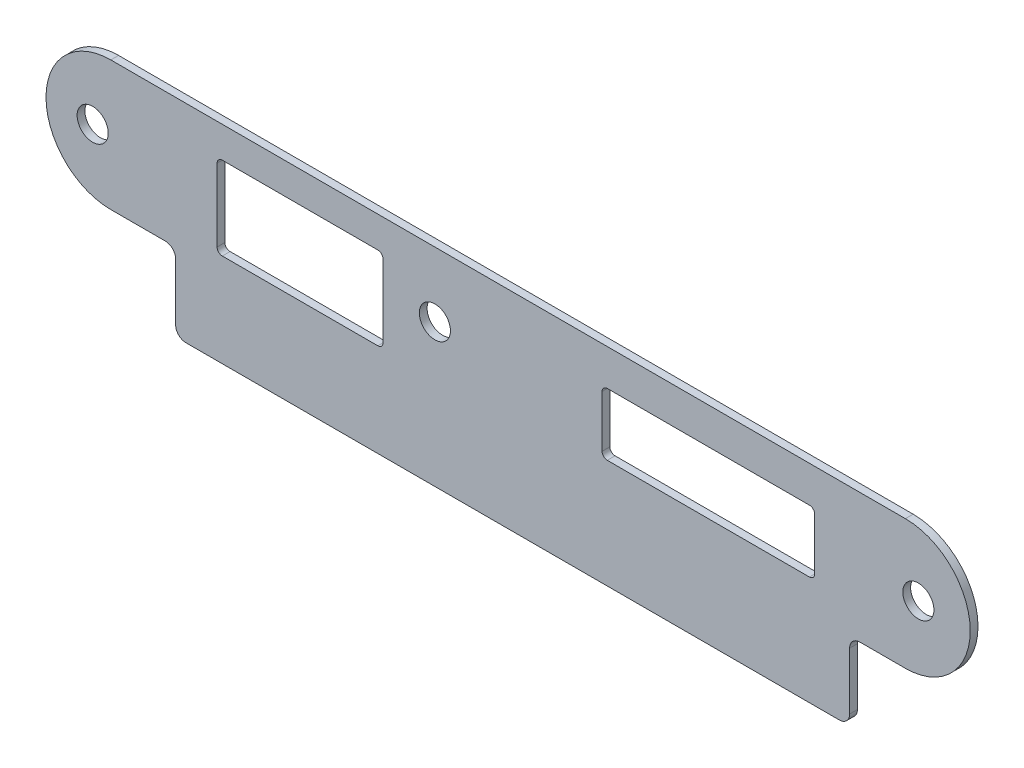
ISO-10303-21;
HEADER;
FILE_DESCRIPTION(('STEP AP214'),'2;1');
FILE_NAME('part.step','',(''),(''),'','','');
FILE_SCHEMA(('AUTOMOTIVE_DESIGN { 1 0 10303 214 1 1 1 1 }'));
ENDSEC;
DATA;
#1=APPLICATION_CONTEXT('core data for automotive mechanical design processes');
#2=APPLICATION_PROTOCOL_DEFINITION('international standard','automotive_design',2000,#1);
#3=PRODUCT_CONTEXT('',#1,'mechanical');
#4=PRODUCT('Part','Part','',(#3));
#5=PRODUCT_RELATED_PRODUCT_CATEGORY('part','',(#4));
#6=PRODUCT_DEFINITION_FORMATION('','',#4);
#7=PRODUCT_DEFINITION_CONTEXT('part definition',#1,'design');
#8=PRODUCT_DEFINITION('design','',#6,#7);
#9=PRODUCT_DEFINITION_SHAPE('','',#8);
#10=(LENGTH_UNIT() NAMED_UNIT(*) SI_UNIT(.MILLI.,.METRE.));
#11=(NAMED_UNIT(*) PLANE_ANGLE_UNIT() SI_UNIT($,.RADIAN.));
#12=(NAMED_UNIT(*) SI_UNIT($,.STERADIAN.) SOLID_ANGLE_UNIT());
#13=UNCERTAINTY_MEASURE_WITH_UNIT(LENGTH_MEASURE(1.E-05),#10,'distance_accuracy_value','');
#14=(GEOMETRIC_REPRESENTATION_CONTEXT(3) GLOBAL_UNCERTAINTY_ASSIGNED_CONTEXT((#13)) GLOBAL_UNIT_ASSIGNED_CONTEXT((#10,
#11,#12)) REPRESENTATION_CONTEXT('',''));
#15=CARTESIAN_POINT('',(0.,0.,0.));
#16=DIRECTION('',(0.,0.,1.));
#17=DIRECTION('',(1.,0.,0.));
#18=AXIS2_PLACEMENT_3D('',#15,#16,#17);
#19=CARTESIAN_POINT('',(-83.,6.50000000000004,1.5));
#20=DIRECTION('',(0.,0.,1.));
#21=DIRECTION('',(1.,0.,0.));
#22=AXIS2_PLACEMENT_3D('',#19,#20,#21);
#23=PLANE('',#22);
#24=DIRECTION('',(-1.,0.,0.));
#25=VECTOR('',#24,1.);
#26=CARTESIAN_POINT('',(51.75,12.0000000000001,1.5));
#27=LINE('',#26,#25);
#28=CARTESIAN_POINT('',(51.75,12.0000000000001,1.5));
#29=VERTEX_POINT('',#28);
#30=CARTESIAN_POINT('',(12.75,12.,1.5));
#31=VERTEX_POINT('',#30);
#32=EDGE_CURVE('E224',#29,#31,#27,.T.);
#33=ORIENTED_EDGE('',*,*,#32,.F.);
#34=CARTESIAN_POINT('',(51.75,11.,1.5));
#35=DIRECTION('',(0.,0.,1.));
#36=DIRECTION('',(1.,0.,0.));
#37=AXIS2_PLACEMENT_3D('',#34,#35,#36);
#38=CIRCLE('',#37,1.00000000000002);
#39=CARTESIAN_POINT('',(52.75,11.,1.5));
#40=VERTEX_POINT('',#39);
#41=EDGE_CURVE('E216',#40,#29,#38,.T.);
#42=ORIENTED_EDGE('',*,*,#41,.F.);
#43=DIRECTION('',(0.,1.,0.));
#44=VECTOR('',#43,1.);
#45=CARTESIAN_POINT('',(52.75,1.00000000000005,1.5));
#46=LINE('',#45,#44);
#47=CARTESIAN_POINT('',(52.75,1.00000000000005,1.5));
#48=VERTEX_POINT('',#47);
#49=EDGE_CURVE('E251',#48,#40,#46,.T.);
#50=ORIENTED_EDGE('',*,*,#49,.F.);
#51=CARTESIAN_POINT('',(51.75,1.00000000000004,1.5));
#52=DIRECTION('',(0.,0.,1.));
#53=DIRECTION('',(1.,0.,0.));
#54=AXIS2_PLACEMENT_3D('',#51,#52,#53);
#55=CIRCLE('',#54,0.999999999999997);
#56=CARTESIAN_POINT('',(51.75,0.,1.5));
#57=VERTEX_POINT('',#56);
#58=EDGE_CURVE('E249',#57,#48,#55,.T.);
#59=ORIENTED_EDGE('',*,*,#58,.F.);
#60=DIRECTION('',(1.,0.,0.));
#61=VECTOR('',#60,1.);
#62=CARTESIAN_POINT('',(12.75,0.,1.5));
#63=LINE('',#62,#61);
#64=CARTESIAN_POINT('',(12.75,0.,1.5));
#65=VERTEX_POINT('',#64);
#66=EDGE_CURVE('E247',#65,#57,#63,.T.);
#67=ORIENTED_EDGE('',*,*,#66,.F.);
#68=CARTESIAN_POINT('',(12.75,1.00000000000004,1.5));
#69=DIRECTION('',(0.,0.,1.));
#70=DIRECTION('',(1.,0.,0.));
#71=AXIS2_PLACEMENT_3D('',#68,#69,#70);
#72=CIRCLE('',#71,0.999999999999999);
#73=CARTESIAN_POINT('',(11.75,1.00000000000004,1.5));
#74=VERTEX_POINT('',#73);
#75=EDGE_CURVE('E245',#74,#65,#72,.T.);
#76=ORIENTED_EDGE('',*,*,#75,.F.);
#77=DIRECTION('',(0.,-1.,0.));
#78=VECTOR('',#77,1.);
#79=CARTESIAN_POINT('',(11.75,11.,1.5));
#80=LINE('',#79,#78);
#81=CARTESIAN_POINT('',(11.75,11.,1.5));
#82=VERTEX_POINT('',#81);
#83=EDGE_CURVE('E240',#82,#74,#80,.T.);
#84=ORIENTED_EDGE('',*,*,#83,.F.);
#85=CARTESIAN_POINT('',(12.75,11.,1.5));
#86=DIRECTION('',(0.,0.,1.));
#87=DIRECTION('',(1.,0.,0.));
#88=AXIS2_PLACEMENT_3D('',#85,#86,#87);
#89=CIRCLE('',#88,1.);
#90=EDGE_CURVE('E238',#31,#82,#89,.T.);
#91=ORIENTED_EDGE('',*,*,#90,.F.);
#92=EDGE_LOOP('',(#33,#42,#50,#59,#67,#76,#84,#91));
#93=FACE_BOUND('',#92,.T.);
#94=DIRECTION('',(0.,-1.,0.));
#95=VECTOR('',#94,1.);
#96=CARTESIAN_POINT('',(-62.5,12.,1.5));
#97=LINE('',#96,#95);
#98=CARTESIAN_POINT('',(-62.5,12.,1.5));
#99=VERTEX_POINT('',#98);
#100=CARTESIAN_POINT('',(-62.5,-2.00000000000002,1.5));
#101=VERTEX_POINT('',#100);
#102=EDGE_CURVE('E292',#99,#101,#97,.T.);
#103=ORIENTED_EDGE('',*,*,#102,.F.);
#104=CARTESIAN_POINT('',(-61.5,12.,1.5));
#105=DIRECTION('',(0.,0.,1.));
#106=DIRECTION('',(1.,0.,0.));
#107=AXIS2_PLACEMENT_3D('',#104,#105,#106);
#108=CIRCLE('',#107,1.);
#109=CARTESIAN_POINT('',(-61.5,13.,1.5));
#110=VERTEX_POINT('',#109);
#111=EDGE_CURVE('E290',#110,#99,#108,.T.);
#112=ORIENTED_EDGE('',*,*,#111,.F.);
#113=DIRECTION('',(-1.,0.,0.));
#114=VECTOR('',#113,1.);
#115=CARTESIAN_POINT('',(-31.5,13.,1.5));
#116=LINE('',#115,#114);
#117=CARTESIAN_POINT('',(-31.5,13.,1.5));
#118=VERTEX_POINT('',#117);
#119=EDGE_CURVE('E306',#118,#110,#116,.T.);
#120=ORIENTED_EDGE('',*,*,#119,.F.);
#121=CARTESIAN_POINT('',(-31.5,12.,1.5));
#122=DIRECTION('',(0.,0.,1.));
#123=DIRECTION('',(1.,0.,0.));
#124=AXIS2_PLACEMENT_3D('',#121,#122,#123);
#125=CIRCLE('',#124,0.999999999999991);
#126=CARTESIAN_POINT('',(-30.5,12.,1.5));
#127=VERTEX_POINT('',#126);
#128=EDGE_CURVE('E303',#127,#118,#125,.T.);
#129=ORIENTED_EDGE('',*,*,#128,.F.);
#130=DIRECTION('',(0.,1.,0.));
#131=VECTOR('',#130,1.);
#132=CARTESIAN_POINT('',(-30.5,-2.00000000000002,1.5));
#133=LINE('',#132,#131);
#134=CARTESIAN_POINT('',(-30.5,-2.00000000000002,1.5));
#135=VERTEX_POINT('',#134);
#136=EDGE_CURVE('E301',#135,#127,#133,.T.);
#137=ORIENTED_EDGE('',*,*,#136,.F.);
#138=CARTESIAN_POINT('',(-31.5,-2.00000000000002,1.5));
#139=DIRECTION('',(0.,0.,1.));
#140=DIRECTION('',(1.,0.,0.));
#141=AXIS2_PLACEMENT_3D('',#138,#139,#140);
#142=CIRCLE('',#141,1.);
#143=CARTESIAN_POINT('',(-31.5,-3.00000000000002,1.5));
#144=VERTEX_POINT('',#143);
#145=EDGE_CURVE('E299',#144,#135,#142,.T.);
#146=ORIENTED_EDGE('',*,*,#145,.F.);
#147=DIRECTION('',(1.,0.,0.));
#148=VECTOR('',#147,1.);
#149=CARTESIAN_POINT('',(-61.5,-3.00000000000003,1.5));
#150=LINE('',#149,#148);
#151=CARTESIAN_POINT('',(-61.5,-3.00000000000003,1.5));
#152=VERTEX_POINT('',#151);
#153=EDGE_CURVE('E297',#152,#144,#150,.T.);
#154=ORIENTED_EDGE('',*,*,#153,.F.);
#155=CARTESIAN_POINT('',(-61.5,-2.00000000000003,1.5));
#156=DIRECTION('',(0.,0.,1.));
#157=DIRECTION('',(1.,0.,0.));
#158=AXIS2_PLACEMENT_3D('',#155,#156,#157);
#159=CIRCLE('',#158,1.);
#160=EDGE_CURVE('E295',#101,#152,#159,.T.);
#161=ORIENTED_EDGE('',*,*,#160,.F.);
#162=EDGE_LOOP('',(#103,#112,#120,#129,#137,#146,#154,#161));
#163=FACE_BOUND('',#162,.T.);
#164=CARTESIAN_POINT('',(-83.,6.50000000000004,1.5));
#165=DIRECTION('',(0.,0.,1.));
#166=DIRECTION('',(1.,0.,0.));
#167=AXIS2_PLACEMENT_3D('',#164,#165,#166);
#168=CIRCLE('',#167,12.5);
#169=CARTESIAN_POINT('',(-83.,19.,1.5));
#170=VERTEX_POINT('',#169);
#171=CARTESIAN_POINT('',(-83.,-5.99999999999994,1.5));
#172=VERTEX_POINT('',#171);
#173=EDGE_CURVE('E355',#170,#172,#168,.T.);
#174=ORIENTED_EDGE('',*,*,#173,.T.);
#175=DIRECTION('',(1.,0.,0.));
#176=VECTOR('',#175,1.);
#177=CARTESIAN_POINT('',(-83.,-5.99999999999994,1.5));
#178=LINE('',#177,#176);
#179=CARTESIAN_POINT('',(-72.5,-6.00000000000005,1.5));
#180=VERTEX_POINT('',#179);
#181=EDGE_CURVE('E358',#172,#180,#178,.T.);
#182=ORIENTED_EDGE('',*,*,#181,.T.);
#183=CARTESIAN_POINT('',(-72.5,-8.00000000000005,1.5));
#184=DIRECTION('',(0.,0.,-1.));
#185=DIRECTION('',(1.,0.,0.));
#186=AXIS2_PLACEMENT_3D('',#183,#184,#185);
#187=CIRCLE('',#186,2.);
#188=CARTESIAN_POINT('',(-70.5,-8.00000000000005,1.5));
#189=VERTEX_POINT('',#188);
#190=EDGE_CURVE('E361',#180,#189,#187,.T.);
#191=ORIENTED_EDGE('',*,*,#190,.T.);
#192=DIRECTION('',(0.,-1.,0.));
#193=VECTOR('',#192,1.);
#194=CARTESIAN_POINT('',(-70.5,-8.00000000000005,1.5));
#195=LINE('',#194,#193);
#196=CARTESIAN_POINT('',(-70.5,-19.,1.5));
#197=VERTEX_POINT('',#196);
#198=EDGE_CURVE('E363',#189,#197,#195,.T.);
#199=ORIENTED_EDGE('',*,*,#198,.T.);
#200=CARTESIAN_POINT('',(-68.5,-19.,1.5));
#201=DIRECTION('',(0.,0.,1.));
#202=DIRECTION('',(1.,0.,0.));
#203=AXIS2_PLACEMENT_3D('',#200,#201,#202);
#204=CIRCLE('',#203,2.00000000000001);
#205=CARTESIAN_POINT('',(-68.5,-21.,1.5));
#206=VERTEX_POINT('',#205);
#207=EDGE_CURVE('E365',#197,#206,#204,.T.);
#208=ORIENTED_EDGE('',*,*,#207,.T.);
#209=DIRECTION('',(1.,0.,0.));
#210=VECTOR('',#209,1.);
#211=CARTESIAN_POINT('',(-68.5,-21.,1.5));
#212=LINE('',#211,#210);
#213=CARTESIAN_POINT('',(57.5,-20.9999999999999,1.5));
#214=VERTEX_POINT('',#213);
#215=EDGE_CURVE('E367',#206,#214,#212,.T.);
#216=ORIENTED_EDGE('',*,*,#215,.T.);
#217=CARTESIAN_POINT('',(57.5,-18.9999999999999,1.5));
#218=DIRECTION('',(0.,0.,1.));
#219=DIRECTION('',(1.,0.,0.));
#220=AXIS2_PLACEMENT_3D('',#217,#218,#219);
#221=CIRCLE('',#220,1.99999999999999);
#222=CARTESIAN_POINT('',(59.5,-18.9999999999999,1.5));
#223=VERTEX_POINT('',#222);
#224=EDGE_CURVE('E369',#214,#223,#221,.T.);
#225=ORIENTED_EDGE('',*,*,#224,.T.);
#226=DIRECTION('',(0.,1.,0.));
#227=VECTOR('',#226,1.);
#228=CARTESIAN_POINT('',(59.5,-18.9999999999999,1.5));
#229=LINE('',#228,#227);
#230=CARTESIAN_POINT('',(59.5,-7.99999999999995,1.5));
#231=VERTEX_POINT('',#230);
#232=EDGE_CURVE('E371',#223,#231,#229,.T.);
#233=ORIENTED_EDGE('',*,*,#232,.T.);
#234=CARTESIAN_POINT('',(61.5,-7.99999999999995,1.5));
#235=DIRECTION('',(0.,0.,-1.));
#236=DIRECTION('',(1.,0.,0.));
#237=AXIS2_PLACEMENT_3D('',#234,#235,#236);
#238=CIRCLE('',#237,2.);
#239=CARTESIAN_POINT('',(61.5,-5.99999999999995,1.5));
#240=VERTEX_POINT('',#239);
#241=EDGE_CURVE('E373',#231,#240,#238,.T.);
#242=ORIENTED_EDGE('',*,*,#241,.T.);
#243=DIRECTION('',(1.,0.,0.));
#244=VECTOR('',#243,1.);
#245=CARTESIAN_POINT('',(61.5,-5.99999999999995,1.5));
#246=LINE('',#245,#244);
#247=CARTESIAN_POINT('',(70.25,-5.99999999999994,1.5));
#248=VERTEX_POINT('',#247);
#249=EDGE_CURVE('E375',#240,#248,#246,.T.);
#250=ORIENTED_EDGE('',*,*,#249,.T.);
#251=CARTESIAN_POINT('',(70.25,6.50000000000006,1.5));
#252=DIRECTION('',(0.,0.,1.));
#253=DIRECTION('',(1.,0.,0.));
#254=AXIS2_PLACEMENT_3D('',#251,#252,#253);
#255=CIRCLE('',#254,12.5);
#256=CARTESIAN_POINT('',(70.25,19.0000000000001,1.5));
#257=VERTEX_POINT('',#256);
#258=EDGE_CURVE('E377',#248,#257,#255,.T.);
#259=ORIENTED_EDGE('',*,*,#258,.T.);
#260=DIRECTION('',(-1.,0.,0.));
#261=VECTOR('',#260,1.);
#262=CARTESIAN_POINT('',(70.25,19.0000000000001,1.5));
#263=LINE('',#262,#261);
#264=EDGE_CURVE('E379',#257,#170,#263,.T.);
#265=ORIENTED_EDGE('',*,*,#264,.T.);
#266=EDGE_LOOP('',(#174,#182,#191,#199,#208,#216,#225,#233,#242,#250,#259,#265));
#267=FACE_BOUND('',#266,.T.);
#268=CARTESIAN_POINT('',(-86.5,6.49999999999999,1.5));
#269=DIRECTION('',(0.,0.,1.));
#270=DIRECTION('',(1.,0.,0.));
#271=AXIS2_PLACEMENT_3D('',#268,#269,#270);
#272=CIRCLE('',#271,3.00000000000001);
#273=CARTESIAN_POINT('',(-83.5,6.49999999999999,1.5));
#274=VERTEX_POINT('',#273);
#275=EDGE_CURVE('E349',#274,#274,#272,.T.);
#276=ORIENTED_EDGE('',*,*,#275,.F.);
#277=EDGE_LOOP('',(#276));
#278=FACE_BOUND('',#277,.T.);
#279=CARTESIAN_POINT('',(-20.5,6.50000000000004,1.5));
#280=DIRECTION('',(0.,0.,1.));
#281=DIRECTION('',(1.,0.,0.));
#282=AXIS2_PLACEMENT_3D('',#279,#280,#281);
#283=CIRCLE('',#282,3.);
#284=CARTESIAN_POINT('',(-17.5,6.50000000000004,1.5));
#285=VERTEX_POINT('',#284);
#286=EDGE_CURVE('E284',#285,#285,#283,.T.);
#287=ORIENTED_EDGE('',*,*,#286,.F.);
#288=EDGE_LOOP('',(#287));
#289=FACE_BOUND('',#288,.T.);
#290=CARTESIAN_POINT('',(72.75,6.50000000000006,1.5));
#291=DIRECTION('',(0.,0.,1.));
#292=DIRECTION('',(1.,0.,0.));
#293=AXIS2_PLACEMENT_3D('',#290,#291,#292);
#294=CIRCLE('',#293,3.00000000000001);
#295=CARTESIAN_POINT('',(75.75,6.50000000000006,1.5));
#296=VERTEX_POINT('',#295);
#297=EDGE_CURVE('E254',#296,#296,#294,.T.);
#298=ORIENTED_EDGE('',*,*,#297,.F.);
#299=EDGE_LOOP('',(#298));
#300=FACE_BOUND('',#299,.T.);
#301=ADVANCED_FACE('F31',(#93,#163,#267,#278,#289,#300),#23,.T.);
#302=CARTESIAN_POINT('',(-83.,6.50000000000004,0.));
#303=DIRECTION('',(0.,0.,1.));
#304=DIRECTION('',(1.,0.,0.));
#305=AXIS2_PLACEMENT_3D('',#302,#303,#304);
#306=PLANE('',#305);
#307=CARTESIAN_POINT('',(51.75,11.,0.));
#308=DIRECTION('',(0.,0.,1.));
#309=DIRECTION('',(1.,0.,0.));
#310=AXIS2_PLACEMENT_3D('',#307,#308,#309);
#311=CIRCLE('',#310,1.00000000000002);
#312=CARTESIAN_POINT('',(52.75,11.,0.));
#313=VERTEX_POINT('',#312);
#314=CARTESIAN_POINT('',(51.75,12.0000000000001,0.));
#315=VERTEX_POINT('',#314);
#316=EDGE_CURVE('E54',#313,#315,#311,.T.);
#317=ORIENTED_EDGE('',*,*,#316,.T.);
#318=DIRECTION('',(-1.,0.,0.));
#319=VECTOR('',#318,1.);
#320=CARTESIAN_POINT('',(51.75,12.0000000000001,0.));
#321=LINE('',#320,#319);
#322=CARTESIAN_POINT('',(12.75,12.,0.));
#323=VERTEX_POINT('',#322);
#324=EDGE_CURVE('E231',#315,#323,#321,.T.);
#325=ORIENTED_EDGE('',*,*,#324,.T.);
#326=CARTESIAN_POINT('',(12.75,11.,0.));
#327=DIRECTION('',(0.,0.,1.));
#328=DIRECTION('',(1.,0.,0.));
#329=AXIS2_PLACEMENT_3D('',#326,#327,#328);
#330=CIRCLE('',#329,1.);
#331=CARTESIAN_POINT('',(11.75,11.,0.));
#332=VERTEX_POINT('',#331);
#333=EDGE_CURVE('E256',#323,#332,#330,.T.);
#334=ORIENTED_EDGE('',*,*,#333,.T.);
#335=DIRECTION('',(0.,-1.,0.));
#336=VECTOR('',#335,1.);
#337=CARTESIAN_POINT('',(11.75,11.,0.));
#338=LINE('',#337,#336);
#339=CARTESIAN_POINT('',(11.75,1.00000000000004,0.));
#340=VERTEX_POINT('',#339);
#341=EDGE_CURVE('E259',#332,#340,#338,.T.);
#342=ORIENTED_EDGE('',*,*,#341,.T.);
#343=CARTESIAN_POINT('',(12.75,1.00000000000004,0.));
#344=DIRECTION('',(0.,0.,1.));
#345=DIRECTION('',(1.,0.,0.));
#346=AXIS2_PLACEMENT_3D('',#343,#344,#345);
#347=CIRCLE('',#346,0.999999999999999);
#348=CARTESIAN_POINT('',(12.75,0.,0.));
#349=VERTEX_POINT('',#348);
#350=EDGE_CURVE('E262',#340,#349,#347,.T.);
#351=ORIENTED_EDGE('',*,*,#350,.T.);
#352=DIRECTION('',(1.,0.,0.));
#353=VECTOR('',#352,1.);
#354=CARTESIAN_POINT('',(12.75,0.,0.));
#355=LINE('',#354,#353);
#356=CARTESIAN_POINT('',(51.75,0.,0.));
#357=VERTEX_POINT('',#356);
#358=EDGE_CURVE('E265',#349,#357,#355,.T.);
#359=ORIENTED_EDGE('',*,*,#358,.T.);
#360=CARTESIAN_POINT('',(51.75,1.00000000000004,0.));
#361=DIRECTION('',(0.,0.,1.));
#362=DIRECTION('',(1.,0.,0.));
#363=AXIS2_PLACEMENT_3D('',#360,#361,#362);
#364=CIRCLE('',#363,0.999999999999997);
#365=CARTESIAN_POINT('',(52.75,1.00000000000005,0.));
#366=VERTEX_POINT('',#365);
#367=EDGE_CURVE('E268',#357,#366,#364,.T.);
#368=ORIENTED_EDGE('',*,*,#367,.T.);
#369=DIRECTION('',(0.,1.,0.));
#370=VECTOR('',#369,1.);
#371=CARTESIAN_POINT('',(52.75,1.00000000000005,0.));
#372=LINE('',#371,#370);
#373=EDGE_CURVE('E225',#366,#313,#372,.T.);
#374=ORIENTED_EDGE('',*,*,#373,.T.);
#375=EDGE_LOOP('',(#317,#325,#334,#342,#351,#359,#368,#374));
#376=FACE_BOUND('',#375,.T.);
#377=CARTESIAN_POINT('',(-61.5,12.,0.));
#378=DIRECTION('',(0.,0.,1.));
#379=DIRECTION('',(1.,0.,0.));
#380=AXIS2_PLACEMENT_3D('',#377,#378,#379);
#381=CIRCLE('',#380,1.);
#382=CARTESIAN_POINT('',(-61.5,13.,0.));
#383=VERTEX_POINT('',#382);
#384=CARTESIAN_POINT('',(-62.5,12.,0.));
#385=VERTEX_POINT('',#384);
#386=EDGE_CURVE('E287',#383,#385,#381,.T.);
#387=ORIENTED_EDGE('',*,*,#386,.T.);
#388=DIRECTION('',(0.,-1.,0.));
#389=VECTOR('',#388,1.);
#390=CARTESIAN_POINT('',(-62.5,12.,0.));
#391=LINE('',#390,#389);
#392=CARTESIAN_POINT('',(-62.5,-2.00000000000002,0.));
#393=VERTEX_POINT('',#392);
#394=EDGE_CURVE('E311',#385,#393,#391,.T.);
#395=ORIENTED_EDGE('',*,*,#394,.T.);
#396=CARTESIAN_POINT('',(-61.5,-2.00000000000003,0.));
#397=DIRECTION('',(0.,0.,1.));
#398=DIRECTION('',(1.,0.,0.));
#399=AXIS2_PLACEMENT_3D('',#396,#397,#398);
#400=CIRCLE('',#399,1.);
#401=CARTESIAN_POINT('',(-61.5,-3.00000000000003,0.));
#402=VERTEX_POINT('',#401);
#403=EDGE_CURVE('E314',#393,#402,#400,.T.);
#404=ORIENTED_EDGE('',*,*,#403,.T.);
#405=DIRECTION('',(1.,0.,0.));
#406=VECTOR('',#405,1.);
#407=CARTESIAN_POINT('',(-61.5,-3.00000000000003,0.));
#408=LINE('',#407,#406);
#409=CARTESIAN_POINT('',(-31.5,-3.00000000000002,0.));
#410=VERTEX_POINT('',#409);
#411=EDGE_CURVE('E317',#402,#410,#408,.T.);
#412=ORIENTED_EDGE('',*,*,#411,.T.);
#413=CARTESIAN_POINT('',(-31.5,-2.00000000000002,0.));
#414=DIRECTION('',(0.,0.,1.));
#415=DIRECTION('',(1.,0.,0.));
#416=AXIS2_PLACEMENT_3D('',#413,#414,#415);
#417=CIRCLE('',#416,1.);
#418=CARTESIAN_POINT('',(-30.5,-2.00000000000002,0.));
#419=VERTEX_POINT('',#418);
#420=EDGE_CURVE('E320',#410,#419,#417,.T.);
#421=ORIENTED_EDGE('',*,*,#420,.T.);
#422=DIRECTION('',(0.,1.,0.));
#423=VECTOR('',#422,1.);
#424=CARTESIAN_POINT('',(-30.5,-2.00000000000002,0.));
#425=LINE('',#424,#423);
#426=CARTESIAN_POINT('',(-30.5,12.,0.));
#427=VERTEX_POINT('',#426);
#428=EDGE_CURVE('E323',#419,#427,#425,.T.);
#429=ORIENTED_EDGE('',*,*,#428,.T.);
#430=CARTESIAN_POINT('',(-31.5,12.,0.));
#431=DIRECTION('',(0.,0.,1.));
#432=DIRECTION('',(1.,0.,0.));
#433=AXIS2_PLACEMENT_3D('',#430,#431,#432);
#434=CIRCLE('',#433,0.999999999999991);
#435=CARTESIAN_POINT('',(-31.5,13.,0.));
#436=VERTEX_POINT('',#435);
#437=EDGE_CURVE('E326',#427,#436,#434,.T.);
#438=ORIENTED_EDGE('',*,*,#437,.T.);
#439=DIRECTION('',(-1.,0.,0.));
#440=VECTOR('',#439,1.);
#441=CARTESIAN_POINT('',(-31.5,13.,0.));
#442=LINE('',#441,#440);
#443=EDGE_CURVE('E293',#436,#383,#442,.T.);
#444=ORIENTED_EDGE('',*,*,#443,.T.);
#445=EDGE_LOOP('',(#387,#395,#404,#412,#421,#429,#438,#444));
#446=FACE_BOUND('',#445,.T.);
#447=CARTESIAN_POINT('',(-83.,6.50000000000004,0.));
#448=DIRECTION('',(0.,0.,1.));
#449=DIRECTION('',(1.,0.,0.));
#450=AXIS2_PLACEMENT_3D('',#447,#448,#449);
#451=CIRCLE('',#450,12.5);
#452=CARTESIAN_POINT('',(-83.,19.,0.));
#453=VERTEX_POINT('',#452);
#454=CARTESIAN_POINT('',(-83.,-5.99999999999994,0.));
#455=VERTEX_POINT('',#454);
#456=EDGE_CURVE('E352',#453,#455,#451,.T.);
#457=ORIENTED_EDGE('',*,*,#456,.F.);
#458=DIRECTION('',(-1.,0.,0.));
#459=VECTOR('',#458,1.);
#460=CARTESIAN_POINT('',(70.25,19.0000000000001,0.));
#461=LINE('',#460,#459);
#462=CARTESIAN_POINT('',(70.25,19.0000000000001,0.));
#463=VERTEX_POINT('',#462);
#464=EDGE_CURVE('E359',#463,#453,#461,.T.);
#465=ORIENTED_EDGE('',*,*,#464,.F.);
#466=CARTESIAN_POINT('',(70.25,6.50000000000006,0.));
#467=DIRECTION('',(0.,0.,1.));
#468=DIRECTION('',(1.,0.,0.));
#469=AXIS2_PLACEMENT_3D('',#466,#467,#468);
#470=CIRCLE('',#469,12.5);
#471=CARTESIAN_POINT('',(70.25,-5.99999999999994,0.));
#472=VERTEX_POINT('',#471);
#473=EDGE_CURVE('E402',#472,#463,#470,.T.);
#474=ORIENTED_EDGE('',*,*,#473,.F.);
#475=DIRECTION('',(1.,0.,0.));
#476=VECTOR('',#475,1.);
#477=CARTESIAN_POINT('',(61.5,-5.99999999999995,0.));
#478=LINE('',#477,#476);
#479=CARTESIAN_POINT('',(61.5,-5.99999999999995,0.));
#480=VERTEX_POINT('',#479);
#481=EDGE_CURVE('E400',#480,#472,#478,.T.);
#482=ORIENTED_EDGE('',*,*,#481,.F.);
#483=CARTESIAN_POINT('',(61.5,-7.99999999999995,0.));
#484=DIRECTION('',(0.,0.,-1.));
#485=DIRECTION('',(1.,0.,0.));
#486=AXIS2_PLACEMENT_3D('',#483,#484,#485);
#487=CIRCLE('',#486,2.);
#488=CARTESIAN_POINT('',(59.5,-7.99999999999995,0.));
#489=VERTEX_POINT('',#488);
#490=EDGE_CURVE('E398',#489,#480,#487,.T.);
#491=ORIENTED_EDGE('',*,*,#490,.F.);
#492=DIRECTION('',(0.,1.,0.));
#493=VECTOR('',#492,1.);
#494=CARTESIAN_POINT('',(59.5,-18.9999999999999,0.));
#495=LINE('',#494,#493);
#496=CARTESIAN_POINT('',(59.5,-18.9999999999999,0.));
#497=VERTEX_POINT('',#496);
#498=EDGE_CURVE('E396',#497,#489,#495,.T.);
#499=ORIENTED_EDGE('',*,*,#498,.F.);
#500=CARTESIAN_POINT('',(57.5,-18.9999999999999,0.));
#501=DIRECTION('',(0.,0.,1.));
#502=DIRECTION('',(1.,0.,0.));
#503=AXIS2_PLACEMENT_3D('',#500,#501,#502);
#504=CIRCLE('',#503,1.99999999999999);
#505=CARTESIAN_POINT('',(57.5,-20.9999999999999,0.));
#506=VERTEX_POINT('',#505);
#507=EDGE_CURVE('E394',#506,#497,#504,.T.);
#508=ORIENTED_EDGE('',*,*,#507,.F.);
#509=DIRECTION('',(1.,0.,0.));
#510=VECTOR('',#509,1.);
#511=CARTESIAN_POINT('',(-68.5,-21.,0.));
#512=LINE('',#511,#510);
#513=CARTESIAN_POINT('',(-68.5,-21.,0.));
#514=VERTEX_POINT('',#513);
#515=EDGE_CURVE('E392',#514,#506,#512,.T.);
#516=ORIENTED_EDGE('',*,*,#515,.F.);
#517=CARTESIAN_POINT('',(-68.5,-19.,0.));
#518=DIRECTION('',(0.,0.,1.));
#519=DIRECTION('',(1.,0.,0.));
#520=AXIS2_PLACEMENT_3D('',#517,#518,#519);
#521=CIRCLE('',#520,2.00000000000001);
#522=CARTESIAN_POINT('',(-70.5,-19.,0.));
#523=VERTEX_POINT('',#522);
#524=EDGE_CURVE('E390',#523,#514,#521,.T.);
#525=ORIENTED_EDGE('',*,*,#524,.F.);
#526=DIRECTION('',(0.,-1.,0.));
#527=VECTOR('',#526,1.);
#528=CARTESIAN_POINT('',(-70.5,-8.00000000000005,0.));
#529=LINE('',#528,#527);
#530=CARTESIAN_POINT('',(-70.5,-8.00000000000005,0.));
#531=VERTEX_POINT('',#530);
#532=EDGE_CURVE('E388',#531,#523,#529,.T.);
#533=ORIENTED_EDGE('',*,*,#532,.F.);
#534=CARTESIAN_POINT('',(-72.5,-8.00000000000005,0.));
#535=DIRECTION('',(0.,0.,-1.));
#536=DIRECTION('',(1.,0.,0.));
#537=AXIS2_PLACEMENT_3D('',#534,#535,#536);
#538=CIRCLE('',#537,2.);
#539=CARTESIAN_POINT('',(-72.5,-6.00000000000005,0.));
#540=VERTEX_POINT('',#539);
#541=EDGE_CURVE('E386',#540,#531,#538,.T.);
#542=ORIENTED_EDGE('',*,*,#541,.F.);
#543=DIRECTION('',(1.,0.,0.));
#544=VECTOR('',#543,1.);
#545=CARTESIAN_POINT('',(-83.,-5.99999999999994,0.));
#546=LINE('',#545,#544);
#547=EDGE_CURVE('E384',#455,#540,#546,.T.);
#548=ORIENTED_EDGE('',*,*,#547,.F.);
#549=EDGE_LOOP('',(#457,#465,#474,#482,#491,#499,#508,#516,#525,#533,#542,#548));
#550=FACE_BOUND('',#549,.T.);
#551=CARTESIAN_POINT('',(-86.5,6.49999999999999,0.));
#552=DIRECTION('',(0.,0.,1.));
#553=DIRECTION('',(1.,0.,0.));
#554=AXIS2_PLACEMENT_3D('',#551,#552,#553);
#555=CIRCLE('',#554,3.00000000000001);
#556=CARTESIAN_POINT('',(-83.5,6.49999999999999,0.));
#557=VERTEX_POINT('',#556);
#558=EDGE_CURVE('E348',#557,#557,#555,.T.);
#559=ORIENTED_EDGE('',*,*,#558,.T.);
#560=EDGE_LOOP('',(#559));
#561=FACE_BOUND('',#560,.T.);
#562=CARTESIAN_POINT('',(-20.5,6.50000000000004,0.));
#563=DIRECTION('',(0.,0.,1.));
#564=DIRECTION('',(1.,0.,0.));
#565=AXIS2_PLACEMENT_3D('',#562,#563,#564);
#566=CIRCLE('',#565,3.);
#567=CARTESIAN_POINT('',(-17.5,6.50000000000004,0.));
#568=VERTEX_POINT('',#567);
#569=EDGE_CURVE('E232',#568,#568,#566,.T.);
#570=ORIENTED_EDGE('',*,*,#569,.T.);
#571=EDGE_LOOP('',(#570));
#572=FACE_BOUND('',#571,.T.);
#573=CARTESIAN_POINT('',(72.75,6.50000000000006,0.));
#574=DIRECTION('',(0.,0.,1.));
#575=DIRECTION('',(1.,0.,0.));
#576=AXIS2_PLACEMENT_3D('',#573,#574,#575);
#577=CIRCLE('',#576,3.00000000000001);
#578=CARTESIAN_POINT('',(75.75,6.50000000000006,0.));
#579=VERTEX_POINT('',#578);
#580=EDGE_CURVE('E797',#579,#579,#577,.T.);
#581=ORIENTED_EDGE('',*,*,#580,.T.);
#582=EDGE_LOOP('',(#581));
#583=FACE_BOUND('',#582,.T.);
#584=ADVANCED_FACE('F444',(#376,#446,#550,#561,#572,#583),#306,.F.);
#585=CARTESIAN_POINT('',(-83.,6.50000000000004,1.5));
#586=DIRECTION('',(0.,0.,-1.));
#587=DIRECTION('',(-1.,0.,0.));
#588=AXIS2_PLACEMENT_3D('',#585,#586,#587);
#589=CYLINDRICAL_SURFACE('',#588,12.5);
#590=ORIENTED_EDGE('',*,*,#456,.T.);
#591=DIRECTION('',(0.,0.,-1.));
#592=VECTOR('',#591,1.);
#593=CARTESIAN_POINT('',(-83.,-5.99999999999994,1.5));
#594=LINE('',#593,#592);
#595=EDGE_CURVE('E11',#172,#455,#594,.T.);
#596=ORIENTED_EDGE('',*,*,#595,.F.);
#597=ORIENTED_EDGE('',*,*,#173,.F.);
#598=DIRECTION('',(0.,0.,-1.));
#599=VECTOR('',#598,1.);
#600=CARTESIAN_POINT('',(-83.,19.,1.5));
#601=LINE('',#600,#599);
#602=EDGE_CURVE('E381',#170,#453,#601,.T.);
#603=ORIENTED_EDGE('',*,*,#602,.T.);
#604=EDGE_LOOP('',(#590,#596,#597,#603));
#605=FACE_BOUND('',#604,.T.);
#606=ADVANCED_FACE('F33',(#605),#589,.T.);
#607=CARTESIAN_POINT('',(-83.,-5.99999999999994,1.5));
#608=DIRECTION('',(0.,1.,0.));
#609=DIRECTION('',(-1.,0.,0.));
#610=AXIS2_PLACEMENT_3D('',#607,#608,#609);
#611=PLANE('',#610);
#612=ORIENTED_EDGE('',*,*,#547,.T.);
#613=DIRECTION('',(0.,0.,-1.));
#614=VECTOR('',#613,1.);
#615=CARTESIAN_POINT('',(-72.5,-6.00000000000005,1.5));
#616=LINE('',#615,#614);
#617=EDGE_CURVE('E39',#180,#540,#616,.T.);
#618=ORIENTED_EDGE('',*,*,#617,.F.);
#619=ORIENTED_EDGE('',*,*,#181,.F.);
#620=ORIENTED_EDGE('',*,*,#595,.T.);
#621=EDGE_LOOP('',(#612,#618,#619,#620));
#622=FACE_BOUND('',#621,.T.);
#623=ADVANCED_FACE('F462',(#622),#611,.F.);
#624=CARTESIAN_POINT('',(-72.5,-8.00000000000005,1.5));
#625=DIRECTION('',(0.,0.,-1.));
#626=DIRECTION('',(-1.,0.,0.));
#627=AXIS2_PLACEMENT_3D('',#624,#625,#626);
#628=CYLINDRICAL_SURFACE('',#627,2.);
#629=ORIENTED_EDGE('',*,*,#541,.T.);
#630=DIRECTION('',(0.,0.,-1.));
#631=VECTOR('',#630,1.);
#632=CARTESIAN_POINT('',(-70.5,-8.00000000000005,1.5));
#633=LINE('',#632,#631);
#634=EDGE_CURVE('E431',#189,#531,#633,.T.);
#635=ORIENTED_EDGE('',*,*,#634,.F.);
#636=ORIENTED_EDGE('',*,*,#190,.F.);
#637=ORIENTED_EDGE('',*,*,#617,.T.);
#638=EDGE_LOOP('',(#629,#635,#636,#637));
#639=FACE_BOUND('',#638,.T.);
#640=ADVANCED_FACE('F438',(#639),#628,.F.);
#641=CARTESIAN_POINT('',(-70.5,-8.00000000000005,1.5));
#642=DIRECTION('',(1.,0.,0.));
#643=DIRECTION('',(0.,0.,-1.));
#644=AXIS2_PLACEMENT_3D('',#641,#642,#643);
#645=PLANE('',#644);
#646=ORIENTED_EDGE('',*,*,#532,.T.);
#647=DIRECTION('',(0.,0.,-1.));
#648=VECTOR('',#647,1.);
#649=CARTESIAN_POINT('',(-70.5,-19.,1.5));
#650=LINE('',#649,#648);
#651=EDGE_CURVE('E428',#197,#523,#650,.T.);
#652=ORIENTED_EDGE('',*,*,#651,.F.);
#653=ORIENTED_EDGE('',*,*,#198,.F.);
#654=ORIENTED_EDGE('',*,*,#634,.T.);
#655=EDGE_LOOP('',(#646,#652,#653,#654));
#656=FACE_BOUND('',#655,.T.);
#657=ADVANCED_FACE('F450',(#656),#645,.F.);
#658=CARTESIAN_POINT('',(-68.5,-19.,1.5));
#659=DIRECTION('',(0.,0.,-1.));
#660=DIRECTION('',(-1.,0.,0.));
#661=AXIS2_PLACEMENT_3D('',#658,#659,#660);
#662=CYLINDRICAL_SURFACE('',#661,2.00000000000001);
#663=ORIENTED_EDGE('',*,*,#524,.T.);
#664=DIRECTION('',(0.,0.,-1.));
#665=VECTOR('',#664,1.);
#666=CARTESIAN_POINT('',(-68.5,-21.,1.5));
#667=LINE('',#666,#665);
#668=EDGE_CURVE('E425',#206,#514,#667,.T.);
#669=ORIENTED_EDGE('',*,*,#668,.F.);
#670=ORIENTED_EDGE('',*,*,#207,.F.);
#671=ORIENTED_EDGE('',*,*,#651,.T.);
#672=EDGE_LOOP('',(#663,#669,#670,#671));
#673=FACE_BOUND('',#672,.T.);
#674=ADVANCED_FACE('F454',(#673),#662,.T.);
#675=CARTESIAN_POINT('',(-68.5,-21.,1.5));
#676=DIRECTION('',(0.,1.,0.));
#677=DIRECTION('',(-1.,0.,0.));
#678=AXIS2_PLACEMENT_3D('',#675,#676,#677);
#679=PLANE('',#678);
#680=ORIENTED_EDGE('',*,*,#515,.T.);
#681=DIRECTION('',(0.,0.,-1.));
#682=VECTOR('',#681,1.);
#683=CARTESIAN_POINT('',(57.5,-20.9999999999999,1.5));
#684=LINE('',#683,#682);
#685=EDGE_CURVE('E422',#214,#506,#684,.T.);
#686=ORIENTED_EDGE('',*,*,#685,.F.);
#687=ORIENTED_EDGE('',*,*,#215,.F.);
#688=ORIENTED_EDGE('',*,*,#668,.T.);
#689=EDGE_LOOP('',(#680,#686,#687,#688));
#690=FACE_BOUND('',#689,.T.);
#691=ADVANCED_FACE('F495',(#690),#679,.F.);
#692=CARTESIAN_POINT('',(57.5,-18.9999999999999,1.5));
#693=DIRECTION('',(0.,0.,-1.));
#694=DIRECTION('',(-1.,0.,0.));
#695=AXIS2_PLACEMENT_3D('',#692,#693,#694);
#696=CYLINDRICAL_SURFACE('',#695,1.99999999999999);
#697=ORIENTED_EDGE('',*,*,#507,.T.);
#698=DIRECTION('',(0.,0.,-1.));
#699=VECTOR('',#698,1.);
#700=CARTESIAN_POINT('',(59.5,-18.9999999999999,1.5));
#701=LINE('',#700,#699);
#702=EDGE_CURVE('E419',#223,#497,#701,.T.);
#703=ORIENTED_EDGE('',*,*,#702,.F.);
#704=ORIENTED_EDGE('',*,*,#224,.F.);
#705=ORIENTED_EDGE('',*,*,#685,.T.);
#706=EDGE_LOOP('',(#697,#703,#704,#705));
#707=FACE_BOUND('',#706,.T.);
#708=ADVANCED_FACE('F493',(#707),#696,.T.);
#709=CARTESIAN_POINT('',(59.5,-18.9999999999999,1.5));
#710=DIRECTION('',(-1.,0.,0.));
#711=DIRECTION('',(0.,-1.,0.));
#712=AXIS2_PLACEMENT_3D('',#709,#710,#711);
#713=PLANE('',#712);
#714=ORIENTED_EDGE('',*,*,#498,.T.);
#715=DIRECTION('',(0.,0.,-1.));
#716=VECTOR('',#715,1.);
#717=CARTESIAN_POINT('',(59.5,-7.99999999999995,1.5));
#718=LINE('',#717,#716);
#719=EDGE_CURVE('E416',#231,#489,#718,.T.);
#720=ORIENTED_EDGE('',*,*,#719,.F.);
#721=ORIENTED_EDGE('',*,*,#232,.F.);
#722=ORIENTED_EDGE('',*,*,#702,.T.);
#723=EDGE_LOOP('',(#714,#720,#721,#722));
#724=FACE_BOUND('',#723,.T.);
#725=ADVANCED_FACE('F489',(#724),#713,.F.);
#726=CARTESIAN_POINT('',(61.5,-7.99999999999995,1.5));
#727=DIRECTION('',(0.,0.,-1.));
#728=DIRECTION('',(-1.,0.,0.));
#729=AXIS2_PLACEMENT_3D('',#726,#727,#728);
#730=CYLINDRICAL_SURFACE('',#729,2.);
#731=ORIENTED_EDGE('',*,*,#490,.T.);
#732=DIRECTION('',(0.,0.,-1.));
#733=VECTOR('',#732,1.);
#734=CARTESIAN_POINT('',(61.5,-5.99999999999995,1.5));
#735=LINE('',#734,#733);
#736=EDGE_CURVE('E413',#240,#480,#735,.T.);
#737=ORIENTED_EDGE('',*,*,#736,.F.);
#738=ORIENTED_EDGE('',*,*,#241,.F.);
#739=ORIENTED_EDGE('',*,*,#719,.T.);
#740=EDGE_LOOP('',(#731,#737,#738,#739));
#741=FACE_BOUND('',#740,.T.);
#742=ADVANCED_FACE('F484',(#741),#730,.F.);
#743=CARTESIAN_POINT('',(61.5,-5.99999999999995,1.5));
#744=DIRECTION('',(0.,1.,0.));
#745=DIRECTION('',(-1.,0.,0.));
#746=AXIS2_PLACEMENT_3D('',#743,#744,#745);
#747=PLANE('',#746);
#748=ORIENTED_EDGE('',*,*,#481,.T.);
#749=DIRECTION('',(0.,0.,-1.));
#750=VECTOR('',#749,1.);
#751=CARTESIAN_POINT('',(70.25,-5.99999999999994,1.5));
#752=LINE('',#751,#750);
#753=EDGE_CURVE('E410',#248,#472,#752,.T.);
#754=ORIENTED_EDGE('',*,*,#753,.F.);
#755=ORIENTED_EDGE('',*,*,#249,.F.);
#756=ORIENTED_EDGE('',*,*,#736,.T.);
#757=EDGE_LOOP('',(#748,#754,#755,#756));
#758=FACE_BOUND('',#757,.T.);
#759=ADVANCED_FACE('F478',(#758),#747,.F.);
#760=CARTESIAN_POINT('',(70.25,6.50000000000006,1.5));
#761=DIRECTION('',(0.,0.,-1.));
#762=DIRECTION('',(-1.,0.,0.));
#763=AXIS2_PLACEMENT_3D('',#760,#761,#762);
#764=CYLINDRICAL_SURFACE('',#763,12.5);
#765=ORIENTED_EDGE('',*,*,#473,.T.);
#766=DIRECTION('',(0.,0.,-1.));
#767=VECTOR('',#766,1.);
#768=CARTESIAN_POINT('',(70.25,19.0000000000001,1.5));
#769=LINE('',#768,#767);
#770=EDGE_CURVE('E407',#257,#463,#769,.T.);
#771=ORIENTED_EDGE('',*,*,#770,.F.);
#772=ORIENTED_EDGE('',*,*,#258,.F.);
#773=ORIENTED_EDGE('',*,*,#753,.T.);
#774=EDGE_LOOP('',(#765,#771,#772,#773));
#775=FACE_BOUND('',#774,.T.);
#776=ADVANCED_FACE('F474',(#775),#764,.T.);
#777=CARTESIAN_POINT('',(70.25,19.0000000000001,1.5));
#778=DIRECTION('',(0.,-1.,0.));
#779=DIRECTION('',(1.,0.,0.));
#780=AXIS2_PLACEMENT_3D('',#777,#778,#779);
#781=PLANE('',#780);
#782=ORIENTED_EDGE('',*,*,#464,.T.);
#783=ORIENTED_EDGE('',*,*,#602,.F.);
#784=ORIENTED_EDGE('',*,*,#264,.F.);
#785=ORIENTED_EDGE('',*,*,#770,.T.);
#786=EDGE_LOOP('',(#782,#783,#784,#785));
#787=FACE_BOUND('',#786,.T.);
#788=ADVANCED_FACE('F469',(#787),#781,.F.);
#789=CARTESIAN_POINT('',(-86.5,6.49999999999999,1.5));
#790=DIRECTION('',(0.,0.,-1.));
#791=DIRECTION('',(-1.,0.,0.));
#792=AXIS2_PLACEMENT_3D('',#789,#790,#791);
#793=CYLINDRICAL_SURFACE('',#792,3.00000000000001);
#794=ORIENTED_EDGE('',*,*,#275,.T.);
#795=EDGE_LOOP('',(#794));
#796=FACE_BOUND('',#795,.T.);
#797=ORIENTED_EDGE('',*,*,#558,.F.);
#798=EDGE_LOOP('',(#797));
#799=FACE_BOUND('',#798,.T.);
#800=ADVANCED_FACE('F512',(#796,#799),#793,.F.);
#801=CARTESIAN_POINT('',(-61.5,12.,1.5));
#802=DIRECTION('',(0.,0.,-1.));
#803=DIRECTION('',(-1.,0.,0.));
#804=AXIS2_PLACEMENT_3D('',#801,#802,#803);
#805=CYLINDRICAL_SURFACE('',#804,1.);
#806=ORIENTED_EDGE('',*,*,#386,.F.);
#807=DIRECTION('',(0.,0.,-1.));
#808=VECTOR('',#807,1.);
#809=CARTESIAN_POINT('',(-61.5,13.,1.5));
#810=LINE('',#809,#808);
#811=EDGE_CURVE('E308',#110,#383,#810,.T.);
#812=ORIENTED_EDGE('',*,*,#811,.F.);
#813=ORIENTED_EDGE('',*,*,#111,.T.);
#814=DIRECTION('',(0.,0.,-1.));
#815=VECTOR('',#814,1.);
#816=CARTESIAN_POINT('',(-62.5,12.,1.5));
#817=LINE('',#816,#815);
#818=EDGE_CURVE('E345',#99,#385,#817,.T.);
#819=ORIENTED_EDGE('',*,*,#818,.T.);
#820=EDGE_LOOP('',(#806,#812,#813,#819));
#821=FACE_BOUND('',#820,.T.);
#822=ADVANCED_FACE('F550',(#821),#805,.F.);
#823=CARTESIAN_POINT('',(-62.5,12.,1.5));
#824=DIRECTION('',(1.,0.,0.));
#825=DIRECTION('',(0.,0.,-1.));
#826=AXIS2_PLACEMENT_3D('',#823,#824,#825);
#827=PLANE('',#826);
#828=ORIENTED_EDGE('',*,*,#394,.F.);
#829=ORIENTED_EDGE('',*,*,#818,.F.);
#830=ORIENTED_EDGE('',*,*,#102,.T.);
#831=DIRECTION('',(0.,0.,-1.));
#832=VECTOR('',#831,1.);
#833=CARTESIAN_POINT('',(-62.5,-2.00000000000002,1.5));
#834=LINE('',#833,#832);
#835=EDGE_CURVE('E343',#101,#393,#834,.T.);
#836=ORIENTED_EDGE('',*,*,#835,.T.);
#837=EDGE_LOOP('',(#828,#829,#830,#836));
#838=FACE_BOUND('',#837,.T.);
#839=ADVANCED_FACE('F557',(#838),#827,.T.);
#840=CARTESIAN_POINT('',(-61.5,-2.00000000000003,1.5));
#841=DIRECTION('',(0.,0.,-1.));
#842=DIRECTION('',(-1.,0.,0.));
#843=AXIS2_PLACEMENT_3D('',#840,#841,#842);
#844=CYLINDRICAL_SURFACE('',#843,1.);
#845=ORIENTED_EDGE('',*,*,#403,.F.);
#846=ORIENTED_EDGE('',*,*,#835,.F.);
#847=ORIENTED_EDGE('',*,*,#160,.T.);
#848=DIRECTION('',(0.,0.,-1.));
#849=VECTOR('',#848,1.);
#850=CARTESIAN_POINT('',(-61.5,-3.00000000000003,1.5));
#851=LINE('',#850,#849);
#852=EDGE_CURVE('E341',#152,#402,#851,.T.);
#853=ORIENTED_EDGE('',*,*,#852,.T.);
#854=EDGE_LOOP('',(#845,#846,#847,#853));
#855=FACE_BOUND('',#854,.T.);
#856=ADVANCED_FACE('F564',(#855),#844,.F.);
#857=CARTESIAN_POINT('',(-61.5,-3.00000000000003,1.5));
#858=DIRECTION('',(0.,1.,0.));
#859=DIRECTION('',(-1.,0.,0.));
#860=AXIS2_PLACEMENT_3D('',#857,#858,#859);
#861=PLANE('',#860);
#862=ORIENTED_EDGE('',*,*,#411,.F.);
#863=ORIENTED_EDGE('',*,*,#852,.F.);
#864=ORIENTED_EDGE('',*,*,#153,.T.);
#865=DIRECTION('',(0.,0.,-1.));
#866=VECTOR('',#865,1.);
#867=CARTESIAN_POINT('',(-31.5,-3.00000000000002,1.5));
#868=LINE('',#867,#866);
#869=EDGE_CURVE('E339',#144,#410,#868,.T.);
#870=ORIENTED_EDGE('',*,*,#869,.T.);
#871=EDGE_LOOP('',(#862,#863,#864,#870));
#872=FACE_BOUND('',#871,.T.);
#873=ADVANCED_FACE('F572',(#872),#861,.T.);
#874=CARTESIAN_POINT('',(-31.5,-2.00000000000002,1.5));
#875=DIRECTION('',(0.,0.,-1.));
#876=DIRECTION('',(-1.,0.,0.));
#877=AXIS2_PLACEMENT_3D('',#874,#875,#876);
#878=CYLINDRICAL_SURFACE('',#877,1.);
#879=ORIENTED_EDGE('',*,*,#420,.F.);
#880=ORIENTED_EDGE('',*,*,#869,.F.);
#881=ORIENTED_EDGE('',*,*,#145,.T.);
#882=DIRECTION('',(0.,0.,-1.));
#883=VECTOR('',#882,1.);
#884=CARTESIAN_POINT('',(-30.5,-2.00000000000002,1.5));
#885=LINE('',#884,#883);
#886=EDGE_CURVE('E337',#135,#419,#885,.T.);
#887=ORIENTED_EDGE('',*,*,#886,.T.);
#888=EDGE_LOOP('',(#879,#880,#881,#887));
#889=FACE_BOUND('',#888,.T.);
#890=ADVANCED_FACE('F580',(#889),#878,.F.);
#891=CARTESIAN_POINT('',(-30.5,-2.00000000000002,1.5));
#892=DIRECTION('',(-1.,0.,0.));
#893=DIRECTION('',(0.,-1.,0.));
#894=AXIS2_PLACEMENT_3D('',#891,#892,#893);
#895=PLANE('',#894);
#896=ORIENTED_EDGE('',*,*,#428,.F.);
#897=ORIENTED_EDGE('',*,*,#886,.F.);
#898=ORIENTED_EDGE('',*,*,#136,.T.);
#899=DIRECTION('',(0.,0.,-1.));
#900=VECTOR('',#899,1.);
#901=CARTESIAN_POINT('',(-30.5,12.,1.5));
#902=LINE('',#901,#900);
#903=EDGE_CURVE('E335',#127,#427,#902,.T.);
#904=ORIENTED_EDGE('',*,*,#903,.T.);
#905=EDGE_LOOP('',(#896,#897,#898,#904));
#906=FACE_BOUND('',#905,.T.);
#907=ADVANCED_FACE('F588',(#906),#895,.T.);
#908=CARTESIAN_POINT('',(-31.5,12.,1.5));
#909=DIRECTION('',(0.,0.,-1.));
#910=DIRECTION('',(-1.,0.,0.));
#911=AXIS2_PLACEMENT_3D('',#908,#909,#910);
#912=CYLINDRICAL_SURFACE('',#911,0.999999999999991);
#913=ORIENTED_EDGE('',*,*,#437,.F.);
#914=ORIENTED_EDGE('',*,*,#903,.F.);
#915=ORIENTED_EDGE('',*,*,#128,.T.);
#916=DIRECTION('',(0.,0.,-1.));
#917=VECTOR('',#916,1.);
#918=CARTESIAN_POINT('',(-31.5,13.,1.5));
#919=LINE('',#918,#917);
#920=EDGE_CURVE('E333',#118,#436,#919,.T.);
#921=ORIENTED_EDGE('',*,*,#920,.T.);
#922=EDGE_LOOP('',(#913,#914,#915,#921));
#923=FACE_BOUND('',#922,.T.);
#924=ADVANCED_FACE('F596',(#923),#912,.F.);
#925=CARTESIAN_POINT('',(-31.5,13.,1.5));
#926=DIRECTION('',(0.,-1.,0.));
#927=DIRECTION('',(1.,0.,0.));
#928=AXIS2_PLACEMENT_3D('',#925,#926,#927);
#929=PLANE('',#928);
#930=ORIENTED_EDGE('',*,*,#443,.F.);
#931=ORIENTED_EDGE('',*,*,#920,.F.);
#932=ORIENTED_EDGE('',*,*,#119,.T.);
#933=ORIENTED_EDGE('',*,*,#811,.T.);
#934=EDGE_LOOP('',(#930,#931,#932,#933));
#935=FACE_BOUND('',#934,.T.);
#936=ADVANCED_FACE('F604',(#935),#929,.T.);
#937=CARTESIAN_POINT('',(-20.5,6.50000000000004,1.5));
#938=DIRECTION('',(0.,0.,-1.));
#939=DIRECTION('',(-1.,0.,0.));
#940=AXIS2_PLACEMENT_3D('',#937,#938,#939);
#941=CYLINDRICAL_SURFACE('',#940,3.);
#942=ORIENTED_EDGE('',*,*,#286,.T.);
#943=EDGE_LOOP('',(#942));
#944=FACE_BOUND('',#943,.T.);
#945=ORIENTED_EDGE('',*,*,#569,.F.);
#946=EDGE_LOOP('',(#945));
#947=FACE_BOUND('',#946,.T.);
#948=ADVANCED_FACE('F612',(#944,#947),#941,.F.);
#949=CARTESIAN_POINT('',(51.75,11.,1.5));
#950=DIRECTION('',(0.,0.,-1.));
#951=DIRECTION('',(-1.,0.,0.));
#952=AXIS2_PLACEMENT_3D('',#949,#950,#951);
#953=CYLINDRICAL_SURFACE('',#952,1.00000000000002);
#954=ORIENTED_EDGE('',*,*,#316,.F.);
#955=DIRECTION('',(0.,0.,-1.));
#956=VECTOR('',#955,1.);
#957=CARTESIAN_POINT('',(52.75,11.,1.5));
#958=LINE('',#957,#956);
#959=EDGE_CURVE('E220',#40,#313,#958,.T.);
#960=ORIENTED_EDGE('',*,*,#959,.F.);
#961=ORIENTED_EDGE('',*,*,#41,.T.);
#962=DIRECTION('',(0.,0.,-1.));
#963=VECTOR('',#962,1.);
#964=CARTESIAN_POINT('',(51.75,12.0000000000001,1.5));
#965=LINE('',#964,#963);
#966=EDGE_CURVE('E219',#29,#315,#965,.T.);
#967=ORIENTED_EDGE('',*,*,#966,.T.);
#968=EDGE_LOOP('',(#954,#960,#961,#967));
#969=FACE_BOUND('',#968,.T.);
#970=ADVANCED_FACE('F218',(#969),#953,.F.);
#971=CARTESIAN_POINT('',(51.75,12.0000000000001,1.5));
#972=DIRECTION('',(0.,-1.,0.));
#973=DIRECTION('',(1.,0.,0.));
#974=AXIS2_PLACEMENT_3D('',#971,#972,#973);
#975=PLANE('',#974);
#976=ORIENTED_EDGE('',*,*,#324,.F.);
#977=ORIENTED_EDGE('',*,*,#966,.F.);
#978=ORIENTED_EDGE('',*,*,#32,.T.);
#979=DIRECTION('',(0.,0.,-1.));
#980=VECTOR('',#979,1.);
#981=CARTESIAN_POINT('',(12.75,12.,1.5));
#982=LINE('',#981,#980);
#983=EDGE_CURVE('E233',#31,#323,#982,.T.);
#984=ORIENTED_EDGE('',*,*,#983,.T.);
#985=EDGE_LOOP('',(#976,#977,#978,#984));
#986=FACE_BOUND('',#985,.T.);
#987=ADVANCED_FACE('F228',(#986),#975,.T.);
#988=CARTESIAN_POINT('',(12.75,11.,1.5));
#989=DIRECTION('',(0.,0.,-1.));
#990=DIRECTION('',(-1.,0.,0.));
#991=AXIS2_PLACEMENT_3D('',#988,#989,#990);
#992=CYLINDRICAL_SURFACE('',#991,1.);
#993=ORIENTED_EDGE('',*,*,#333,.F.);
#994=ORIENTED_EDGE('',*,*,#983,.F.);
#995=ORIENTED_EDGE('',*,*,#90,.T.);
#996=DIRECTION('',(0.,0.,-1.));
#997=VECTOR('',#996,1.);
#998=CARTESIAN_POINT('',(11.75,11.,1.5));
#999=LINE('',#998,#997);
#1000=EDGE_CURVE('E281',#82,#332,#999,.T.);
#1001=ORIENTED_EDGE('',*,*,#1000,.T.);
#1002=EDGE_LOOP('',(#993,#994,#995,#1001));
#1003=FACE_BOUND('',#1002,.T.);
#1004=ADVANCED_FACE('F633',(#1003),#992,.F.);
#1005=CARTESIAN_POINT('',(11.75,11.,1.5));
#1006=DIRECTION('',(1.,0.,0.));
#1007=DIRECTION('',(0.,0.,-1.));
#1008=AXIS2_PLACEMENT_3D('',#1005,#1006,#1007);
#1009=PLANE('',#1008);
#1010=ORIENTED_EDGE('',*,*,#341,.F.);
#1011=ORIENTED_EDGE('',*,*,#1000,.F.);
#1012=ORIENTED_EDGE('',*,*,#83,.T.);
#1013=DIRECTION('',(0.,0.,-1.));
#1014=VECTOR('',#1013,1.);
#1015=CARTESIAN_POINT('',(11.75,1.00000000000004,1.5));
#1016=LINE('',#1015,#1014);
#1017=EDGE_CURVE('E279',#74,#340,#1016,.T.);
#1018=ORIENTED_EDGE('',*,*,#1017,.T.);
#1019=EDGE_LOOP('',(#1010,#1011,#1012,#1018));
#1020=FACE_BOUND('',#1019,.T.);
#1021=ADVANCED_FACE('F640',(#1020),#1009,.T.);
#1022=CARTESIAN_POINT('',(12.75,1.00000000000004,1.5));
#1023=DIRECTION('',(0.,0.,-1.));
#1024=DIRECTION('',(-1.,0.,0.));
#1025=AXIS2_PLACEMENT_3D('',#1022,#1023,#1024);
#1026=CYLINDRICAL_SURFACE('',#1025,0.999999999999999);
#1027=ORIENTED_EDGE('',*,*,#350,.F.);
#1028=ORIENTED_EDGE('',*,*,#1017,.F.);
#1029=ORIENTED_EDGE('',*,*,#75,.T.);
#1030=DIRECTION('',(0.,0.,-1.));
#1031=VECTOR('',#1030,1.);
#1032=CARTESIAN_POINT('',(12.75,0.,1.5));
#1033=LINE('',#1032,#1031);
#1034=EDGE_CURVE('E277',#65,#349,#1033,.T.);
#1035=ORIENTED_EDGE('',*,*,#1034,.T.);
#1036=EDGE_LOOP('',(#1027,#1028,#1029,#1035));
#1037=FACE_BOUND('',#1036,.T.);
#1038=ADVANCED_FACE('F648',(#1037),#1026,.F.);
#1039=CARTESIAN_POINT('',(12.75,0.,1.5));
#1040=DIRECTION('',(0.,1.,0.));
#1041=DIRECTION('',(-1.,0.,0.));
#1042=AXIS2_PLACEMENT_3D('',#1039,#1040,#1041);
#1043=PLANE('',#1042);
#1044=ORIENTED_EDGE('',*,*,#358,.F.);
#1045=ORIENTED_EDGE('',*,*,#1034,.F.);
#1046=ORIENTED_EDGE('',*,*,#66,.T.);
#1047=DIRECTION('',(0.,0.,-1.));
#1048=VECTOR('',#1047,1.);
#1049=CARTESIAN_POINT('',(51.75,0.,1.5));
#1050=LINE('',#1049,#1048);
#1051=EDGE_CURVE('E275',#57,#357,#1050,.T.);
#1052=ORIENTED_EDGE('',*,*,#1051,.T.);
#1053=EDGE_LOOP('',(#1044,#1045,#1046,#1052));
#1054=FACE_BOUND('',#1053,.T.);
#1055=ADVANCED_FACE('F656',(#1054),#1043,.T.);
#1056=CARTESIAN_POINT('',(51.75,1.00000000000004,1.5));
#1057=DIRECTION('',(0.,0.,-1.));
#1058=DIRECTION('',(-1.,0.,0.));
#1059=AXIS2_PLACEMENT_3D('',#1056,#1057,#1058);
#1060=CYLINDRICAL_SURFACE('',#1059,0.999999999999997);
#1061=ORIENTED_EDGE('',*,*,#367,.F.);
#1062=ORIENTED_EDGE('',*,*,#1051,.F.);
#1063=ORIENTED_EDGE('',*,*,#58,.T.);
#1064=DIRECTION('',(0.,0.,-1.));
#1065=VECTOR('',#1064,1.);
#1066=CARTESIAN_POINT('',(52.75,1.00000000000005,1.5));
#1067=LINE('',#1066,#1065);
#1068=EDGE_CURVE('E46',#48,#366,#1067,.T.);
#1069=ORIENTED_EDGE('',*,*,#1068,.T.);
#1070=EDGE_LOOP('',(#1061,#1062,#1063,#1069));
#1071=FACE_BOUND('',#1070,.T.);
#1072=ADVANCED_FACE('F664',(#1071),#1060,.F.);
#1073=CARTESIAN_POINT('',(52.75,1.00000000000005,1.5));
#1074=DIRECTION('',(-1.,0.,0.));
#1075=DIRECTION('',(0.,-1.,0.));
#1076=AXIS2_PLACEMENT_3D('',#1073,#1074,#1075);
#1077=PLANE('',#1076);
#1078=ORIENTED_EDGE('',*,*,#373,.F.);
#1079=ORIENTED_EDGE('',*,*,#1068,.F.);
#1080=ORIENTED_EDGE('',*,*,#49,.T.);
#1081=ORIENTED_EDGE('',*,*,#959,.T.);
#1082=EDGE_LOOP('',(#1078,#1079,#1080,#1081));
#1083=FACE_BOUND('',#1082,.T.);
#1084=ADVANCED_FACE('F672',(#1083),#1077,.T.);
#1085=CARTESIAN_POINT('',(72.75,6.50000000000006,1.5));
#1086=DIRECTION('',(0.,0.,-1.));
#1087=DIRECTION('',(-1.,0.,0.));
#1088=AXIS2_PLACEMENT_3D('',#1085,#1086,#1087);
#1089=CYLINDRICAL_SURFACE('',#1088,3.00000000000001);
#1090=ORIENTED_EDGE('',*,*,#297,.T.);
#1091=EDGE_LOOP('',(#1090));
#1092=FACE_BOUND('',#1091,.T.);
#1093=ORIENTED_EDGE('',*,*,#580,.F.);
#1094=EDGE_LOOP('',(#1093));
#1095=FACE_BOUND('',#1094,.T.);
#1096=ADVANCED_FACE('F680',(#1092,#1095),#1089,.F.);
#1097=CLOSED_SHELL('',(#301,#584,#606,#623,#640,#657,#674,#691,#708,#725,#742,#759,#776,#788,
#800,#822,#839,#856,#873,#890,#907,#924,#936,#948,#970,#987,#1004,#1021,#1038,#1055,#1072,#1084,#1096));
#1098=MANIFOLD_SOLID_BREP('B2',#1097);
#1099=ADVANCED_BREP_SHAPE_REPRESENTATION('',(#18,#1098),#14);
#1100=SHAPE_DEFINITION_REPRESENTATION(#9,#1099);
ENDSEC;
END-ISO-10303-21;
